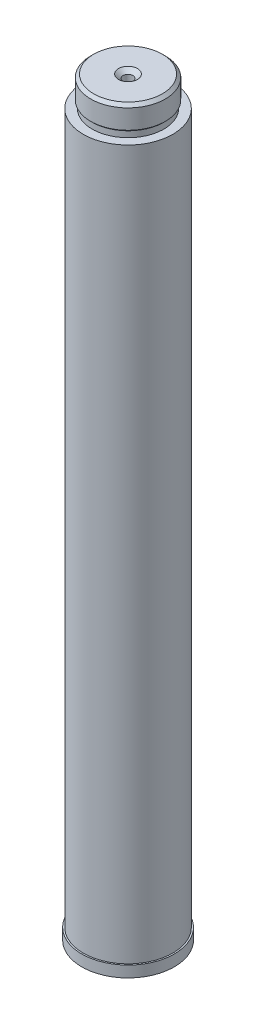
ISO-10303-21;
HEADER;
FILE_DESCRIPTION(('STEP AP214'),'2;1');
FILE_NAME('part.step','',(''),(''),'','','');
FILE_SCHEMA(('AUTOMOTIVE_DESIGN { 1 0 10303 214 1 1 1 1 }'));
ENDSEC;
DATA;
#1=APPLICATION_CONTEXT('core data for automotive mechanical design processes');
#2=APPLICATION_PROTOCOL_DEFINITION('international standard','automotive_design',2000,#1);
#3=PRODUCT_CONTEXT('',#1,'mechanical');
#4=PRODUCT('Part','Part','',(#3));
#5=PRODUCT_RELATED_PRODUCT_CATEGORY('part','',(#4));
#6=PRODUCT_DEFINITION_FORMATION('','',#4);
#7=PRODUCT_DEFINITION_CONTEXT('part definition',#1,'design');
#8=PRODUCT_DEFINITION('design','',#6,#7);
#9=PRODUCT_DEFINITION_SHAPE('','',#8);
#10=(LENGTH_UNIT() NAMED_UNIT(*) SI_UNIT(.MILLI.,.METRE.));
#11=(NAMED_UNIT(*) PLANE_ANGLE_UNIT() SI_UNIT($,.RADIAN.));
#12=(NAMED_UNIT(*) SI_UNIT($,.STERADIAN.) SOLID_ANGLE_UNIT());
#13=UNCERTAINTY_MEASURE_WITH_UNIT(LENGTH_MEASURE(1.E-05),#10,'distance_accuracy_value','');
#14=(GEOMETRIC_REPRESENTATION_CONTEXT(3) GLOBAL_UNCERTAINTY_ASSIGNED_CONTEXT((#13)) GLOBAL_UNIT_ASSIGNED_CONTEXT((#10,
#11,#12)) REPRESENTATION_CONTEXT('',''));
#15=CARTESIAN_POINT('',(0.,0.,0.));
#16=DIRECTION('',(0.,0.,1.));
#17=DIRECTION('',(1.,0.,0.));
#18=AXIS2_PLACEMENT_3D('',#15,#16,#17);
#19=CARTESIAN_POINT('',(0.,9.525,0.));
#20=DIRECTION('',(0.,-1.,0.));
#21=DIRECTION('',(0.,0.,-1.));
#22=AXIS2_PLACEMENT_3D('',#19,#20,#21);
#23=CYLINDRICAL_SURFACE('',#22,39.37);
#24=CARTESIAN_POINT('',(0.,9.525,0.));
#25=DIRECTION('',(0.,1.,0.));
#26=DIRECTION('',(0.,0.,1.));
#27=AXIS2_PLACEMENT_3D('',#24,#25,#26);
#28=CIRCLE('',#27,39.37);
#29=CARTESIAN_POINT('',(0.,9.525,-39.37));
#30=VERTEX_POINT('',#29);
#31=EDGE_CURVE('E39',#30,#30,#28,.T.);
#32=CARTESIAN_POINT('',(0.,0.,0.));
#33=DIRECTION('',(0.,1.,0.));
#34=DIRECTION('',(0.,0.,1.));
#35=AXIS2_PLACEMENT_3D('',#32,#33,#34);
#36=CIRCLE('',#35,39.37);
#37=CARTESIAN_POINT('',(0.,0.,-39.37));
#38=VERTEX_POINT('',#37);
#39=EDGE_CURVE('E35',#38,#38,#36,.T.);
#40=CARTESIAN_POINT('',(0.,9.525,-39.37));
#41=CARTESIAN_POINT('',(0.,9.42578125,-39.37));
#42=CARTESIAN_POINT('',(0.,9.3265625,-39.37));
#43=CARTESIAN_POINT('',(0.,9.128125,-39.37));
#44=CARTESIAN_POINT('',(0.,9.02890625,-39.37));
#45=CARTESIAN_POINT('',(0.,8.83046875,-39.37));
#46=CARTESIAN_POINT('',(0.,8.73125,-39.37));
#47=CARTESIAN_POINT('',(0.,8.5328125,-39.37));
#48=CARTESIAN_POINT('',(0.,8.43359375,-39.37));
#49=CARTESIAN_POINT('',(0.,8.23515625,-39.37));
#50=CARTESIAN_POINT('',(0.,8.1359375,-39.37));
#51=CARTESIAN_POINT('',(0.,7.9375,-39.37));
#52=CARTESIAN_POINT('',(0.,7.83828125,-39.37));
#53=CARTESIAN_POINT('',(0.,7.63984375,-39.37));
#54=CARTESIAN_POINT('',(0.,7.540625,-39.37));
#55=CARTESIAN_POINT('',(0.,7.3421875,-39.37));
#56=CARTESIAN_POINT('',(0.,7.24296875,-39.37));
#57=CARTESIAN_POINT('',(0.,7.04453125,-39.37));
#58=CARTESIAN_POINT('',(0.,6.9453125,-39.37));
#59=CARTESIAN_POINT('',(0.,6.746875,-39.37));
#60=CARTESIAN_POINT('',(0.,6.64765625,-39.37));
#61=CARTESIAN_POINT('',(0.,6.44921875,-39.37));
#62=CARTESIAN_POINT('',(0.,6.35,-39.37));
#63=CARTESIAN_POINT('',(0.,6.1515625,-39.37));
#64=CARTESIAN_POINT('',(0.,6.05234375,-39.37));
#65=CARTESIAN_POINT('',(0.,5.85390625,-39.37));
#66=CARTESIAN_POINT('',(0.,5.7546875,-39.37));
#67=CARTESIAN_POINT('',(0.,5.55625,-39.37));
#68=CARTESIAN_POINT('',(0.,5.45703125,-39.37));
#69=CARTESIAN_POINT('',(0.,5.25859375,-39.37));
#70=CARTESIAN_POINT('',(0.,5.159375,-39.37));
#71=CARTESIAN_POINT('',(0.,4.9609375,-39.37));
#72=CARTESIAN_POINT('',(0.,4.86171875,-39.37));
#73=CARTESIAN_POINT('',(0.,4.66328125,-39.37));
#74=CARTESIAN_POINT('',(0.,4.5640625,-39.37));
#75=CARTESIAN_POINT('',(0.,4.365625,-39.37));
#76=CARTESIAN_POINT('',(0.,4.26640625,-39.37));
#77=CARTESIAN_POINT('',(0.,4.06796875,-39.37));
#78=CARTESIAN_POINT('',(0.,3.96875,-39.37));
#79=CARTESIAN_POINT('',(0.,3.7703125,-39.37));
#80=CARTESIAN_POINT('',(0.,3.67109375,-39.37));
#81=CARTESIAN_POINT('',(0.,3.47265625,-39.37));
#82=CARTESIAN_POINT('',(0.,3.3734375,-39.37));
#83=CARTESIAN_POINT('',(0.,3.175,-39.37));
#84=CARTESIAN_POINT('',(0.,3.07578125,-39.37));
#85=CARTESIAN_POINT('',(0.,2.87734375,-39.37));
#86=CARTESIAN_POINT('',(0.,2.778125,-39.37));
#87=CARTESIAN_POINT('',(0.,2.5796875,-39.37));
#88=CARTESIAN_POINT('',(0.,2.48046875,-39.37));
#89=CARTESIAN_POINT('',(0.,2.28203125,-39.37));
#90=CARTESIAN_POINT('',(0.,2.1828125,-39.37));
#91=CARTESIAN_POINT('',(0.,1.984375,-39.37));
#92=CARTESIAN_POINT('',(0.,1.88515625,-39.37));
#93=CARTESIAN_POINT('',(0.,1.68671875,-39.37));
#94=CARTESIAN_POINT('',(0.,1.5875,-39.37));
#95=CARTESIAN_POINT('',(0.,1.3890625,-39.37));
#96=CARTESIAN_POINT('',(0.,1.28984375,-39.37));
#97=CARTESIAN_POINT('',(0.,1.09140625,-39.37));
#98=CARTESIAN_POINT('',(0.,0.992187500000001,-39.37));
#99=CARTESIAN_POINT('',(0.,0.793750000000001,-39.37));
#100=CARTESIAN_POINT('',(0.,0.69453125,-39.37));
#101=CARTESIAN_POINT('',(0.,0.49609375,-39.37));
#102=CARTESIAN_POINT('',(0.,0.396875,-39.37));
#103=CARTESIAN_POINT('',(0.,0.1984375,-39.37));
#104=CARTESIAN_POINT('',(0.,0.0992187500000001,-39.37));
#105=CARTESIAN_POINT('',(0.,0.,-39.37));
#106=B_SPLINE_CURVE_WITH_KNOTS('',3,(#40,#41,#42,#43,#44,#45,#46,#47,#48,#49,#50,#51,#52,#53,
#54,#55,#56,#57,#58,#59,#60,#61,#62,#63,#64,#65,#66,#67,#68,#69,#70,#71,#72,#73,#74,#75,#76,#77,
#78,#79,#80,#81,#82,#83,#84,#85,#86,#87,#88,#89,#90,#91,#92,#93,#94,#95,#96,#97,#98,#99,#100,
#101,#102,#103,#104,#105),.UNSPECIFIED.,.F.,.F.,(4,2,2,2,2,2,2,2,2,2,2,2,2,2,2,2,2,2,2,2,2,2,2,
2,2,2,2,2,2,2,2,2,4),(0.,0.297656249999998,0.595312499999999,0.892968749999999,1.190625,
1.48828125,1.7859375,2.08359375,2.38125,2.67890625,2.9765625,3.27421875,3.571875,3.86953125,
4.1671875,4.46484375,4.7625,5.06015625,5.3578125,5.65546875,5.953125,6.25078125,6.5484375,
6.84609375,7.14375,7.44140625,7.7390625,8.03671875,8.334375,8.63203125,8.9296875,9.22734375,
9.525),.UNSPECIFIED.);
#107=EDGE_CURVE('BSEAM32',#30,#38,#106,.T.);
#108=ORIENTED_EDGE('',*,*,#31,.F.);
#109=ORIENTED_EDGE('',*,*,#39,.T.);
#110=ORIENTED_EDGE('',*,*,#107,.T.);
#111=ORIENTED_EDGE('',*,*,#107,.F.);
#112=EDGE_LOOP('',(#108,#110,#109,#111));
#113=FACE_BOUND('',#112,.T.);
#114=ADVANCED_FACE('F32',(#113),#23,.T.);
#115=CARTESIAN_POINT('',(0.,9.525,0.));
#116=DIRECTION('',(0.,1.,0.));
#117=DIRECTION('',(0.,0.,1.));
#118=AXIS2_PLACEMENT_3D('',#115,#116,#117);
#119=PLANE('',#118);
#120=CARTESIAN_POINT('',(0.,9.525,0.));
#121=DIRECTION('',(0.,1.,0.));
#122=DIRECTION('',(0.,0.,1.));
#123=AXIS2_PLACEMENT_3D('',#120,#121,#122);
#124=CIRCLE('',#123,38.1);
#125=CARTESIAN_POINT('',(0.,9.525,38.1));
#126=VERTEX_POINT('',#125);
#127=EDGE_CURVE('E11',#126,#126,#124,.T.);
#128=ORIENTED_EDGE('',*,*,#127,.F.);
#129=EDGE_LOOP('',(#128));
#130=FACE_BOUND('',#129,.T.);
#131=ORIENTED_EDGE('',*,*,#31,.T.);
#132=EDGE_LOOP('',(#131));
#133=FACE_BOUND('',#132,.T.);
#134=ADVANCED_FACE('F99',(#130,#133),#119,.T.);
#135=CARTESIAN_POINT('',(0.,0.,0.));
#136=DIRECTION('',(0.,1.,0.));
#137=DIRECTION('',(0.,0.,1.));
#138=AXIS2_PLACEMENT_3D('',#135,#136,#137);
#139=PLANE('',#138);
#140=CARTESIAN_POINT('',(0.,0.,0.));
#141=DIRECTION('',(0.,1.,0.));
#142=DIRECTION('',(0.,0.,1.));
#143=AXIS2_PLACEMENT_3D('',#140,#141,#142);
#144=CIRCLE('',#143,36.83);
#145=CARTESIAN_POINT('',(0.,0.,-36.83));
#146=VERTEX_POINT('',#145);
#147=EDGE_CURVE('E80',#146,#146,#144,.T.);
#148=ORIENTED_EDGE('',*,*,#147,.T.);
#149=EDGE_LOOP('',(#148));
#150=FACE_BOUND('',#149,.T.);
#151=ORIENTED_EDGE('',*,*,#39,.F.);
#152=EDGE_LOOP('',(#151));
#153=FACE_BOUND('',#152,.T.);
#154=ADVANCED_FACE('F96',(#150,#153),#139,.F.);
#155=CARTESIAN_POINT('',(0.,612.775,0.));
#156=DIRECTION('',(0.,-1.,0.));
#157=DIRECTION('',(0.,0.,-1.));
#158=AXIS2_PLACEMENT_3D('',#155,#156,#157);
#159=CYLINDRICAL_SURFACE('',#158,38.1);
#160=CARTESIAN_POINT('',(0.,612.775,0.));
#161=DIRECTION('',(0.,1.,0.));
#162=DIRECTION('',(0.,0.,1.));
#163=AXIS2_PLACEMENT_3D('',#160,#161,#162);
#164=CIRCLE('',#163,38.1);
#165=CARTESIAN_POINT('',(0.,612.775,38.1));
#166=VERTEX_POINT('',#165);
#167=EDGE_CURVE('E83',#166,#166,#164,.T.);
#168=ORIENTED_EDGE('',*,*,#167,.F.);
#169=EDGE_LOOP('',(#168));
#170=FACE_BOUND('',#169,.T.);
#171=ORIENTED_EDGE('',*,*,#127,.T.);
#172=EDGE_LOOP('',(#171));
#173=FACE_BOUND('',#172,.T.);
#174=ADVANCED_FACE('F98',(#170,#173),#159,.T.);
#175=CARTESIAN_POINT('',(0.,612.775,0.));
#176=DIRECTION('',(0.,1.,0.));
#177=DIRECTION('',(0.,0.,1.));
#178=AXIS2_PLACEMENT_3D('',#175,#176,#177);
#179=PLANE('',#178);
#180=CARTESIAN_POINT('',(0.,612.775,0.));
#181=DIRECTION('',(0.,-1.,0.));
#182=DIRECTION('',(0.,0.,-1.));
#183=AXIS2_PLACEMENT_3D('',#180,#181,#182);
#184=CIRCLE('',#183,30.48);
#185=CARTESIAN_POINT('',(0.,612.775,-30.48));
#186=VERTEX_POINT('',#185);
#187=EDGE_CURVE('E72',#186,#186,#184,.T.);
#188=ORIENTED_EDGE('',*,*,#187,.T.);
#189=EDGE_LOOP('',(#188));
#190=FACE_BOUND('',#189,.T.);
#191=ORIENTED_EDGE('',*,*,#167,.T.);
#192=EDGE_LOOP('',(#191));
#193=FACE_BOUND('',#192,.T.);
#194=ADVANCED_FACE('F105',(#190,#193),#179,.T.);
#195=CARTESIAN_POINT('',(0.,9.525,0.));
#196=DIRECTION('',(0.,-1.,0.));
#197=DIRECTION('',(0.,0.,-1.));
#198=AXIS2_PLACEMENT_3D('',#195,#196,#197);
#199=CYLINDRICAL_SURFACE('',#198,36.83);
#200=CARTESIAN_POINT('',(0.,6.985,0.));
#201=DIRECTION('',(0.,1.,0.));
#202=DIRECTION('',(0.,0.,1.));
#203=AXIS2_PLACEMENT_3D('',#200,#201,#202);
#204=CIRCLE('',#203,36.83);
#205=CARTESIAN_POINT('',(0.,6.985,-36.83));
#206=VERTEX_POINT('',#205);
#207=EDGE_CURVE('E76',#206,#206,#204,.T.);
#208=CARTESIAN_POINT('',(0.,6.985,-36.83));
#209=CARTESIAN_POINT('',(0.,6.91223958333333,-36.83));
#210=CARTESIAN_POINT('',(0.,6.83947916666667,-36.83));
#211=CARTESIAN_POINT('',(0.,6.69395833333333,-36.83));
#212=CARTESIAN_POINT('',(0.,6.62119791666667,-36.83));
#213=CARTESIAN_POINT('',(0.,6.47567708333333,-36.83));
#214=CARTESIAN_POINT('',(0.,6.40291666666667,-36.83));
#215=CARTESIAN_POINT('',(0.,6.25739583333333,-36.83));
#216=CARTESIAN_POINT('',(0.,6.18463541666667,-36.83));
#217=CARTESIAN_POINT('',(0.,6.03911458333333,-36.83));
#218=CARTESIAN_POINT('',(0.,5.96635416666667,-36.83));
#219=CARTESIAN_POINT('',(0.,5.82083333333333,-36.83));
#220=CARTESIAN_POINT('',(0.,5.74807291666667,-36.83));
#221=CARTESIAN_POINT('',(0.,5.60255208333333,-36.83));
#222=CARTESIAN_POINT('',(0.,5.52979166666667,-36.83));
#223=CARTESIAN_POINT('',(0.,5.38427083333333,-36.83));
#224=CARTESIAN_POINT('',(0.,5.31151041666667,-36.83));
#225=CARTESIAN_POINT('',(0.,5.16598958333333,-36.83));
#226=CARTESIAN_POINT('',(0.,5.09322916666667,-36.83));
#227=CARTESIAN_POINT('',(0.,4.94770833333333,-36.83));
#228=CARTESIAN_POINT('',(0.,4.87494791666667,-36.83));
#229=CARTESIAN_POINT('',(0.,4.72942708333333,-36.83));
#230=CARTESIAN_POINT('',(0.,4.65666666666667,-36.83));
#231=CARTESIAN_POINT('',(0.,4.51114583333333,-36.83));
#232=CARTESIAN_POINT('',(0.,4.43838541666667,-36.83));
#233=CARTESIAN_POINT('',(0.,4.29286458333333,-36.83));
#234=CARTESIAN_POINT('',(0.,4.22010416666667,-36.83));
#235=CARTESIAN_POINT('',(0.,4.07458333333333,-36.83));
#236=CARTESIAN_POINT('',(0.,4.00182291666667,-36.83));
#237=CARTESIAN_POINT('',(0.,3.85630208333333,-36.83));
#238=CARTESIAN_POINT('',(0.,3.78354166666667,-36.83));
#239=CARTESIAN_POINT('',(0.,3.63802083333333,-36.83));
#240=CARTESIAN_POINT('',(0.,3.56526041666667,-36.83));
#241=CARTESIAN_POINT('',(0.,3.41973958333333,-36.83));
#242=CARTESIAN_POINT('',(0.,3.34697916666667,-36.83));
#243=CARTESIAN_POINT('',(0.,3.20145833333333,-36.83));
#244=CARTESIAN_POINT('',(0.,3.12869791666667,-36.83));
#245=CARTESIAN_POINT('',(0.,2.98317708333333,-36.83));
#246=CARTESIAN_POINT('',(0.,2.91041666666667,-36.83));
#247=CARTESIAN_POINT('',(0.,2.76489583333333,-36.83));
#248=CARTESIAN_POINT('',(0.,2.69213541666667,-36.83));
#249=CARTESIAN_POINT('',(0.,2.54661458333333,-36.83));
#250=CARTESIAN_POINT('',(0.,2.47385416666667,-36.83));
#251=CARTESIAN_POINT('',(0.,2.32833333333333,-36.83));
#252=CARTESIAN_POINT('',(0.,2.25557291666667,-36.83));
#253=CARTESIAN_POINT('',(0.,2.11005208333333,-36.83));
#254=CARTESIAN_POINT('',(0.,2.03729166666667,-36.83));
#255=CARTESIAN_POINT('',(0.,1.89177083333333,-36.83));
#256=CARTESIAN_POINT('',(0.,1.81901041666667,-36.83));
#257=CARTESIAN_POINT('',(0.,1.67348958333333,-36.83));
#258=CARTESIAN_POINT('',(0.,1.60072916666667,-36.83));
#259=CARTESIAN_POINT('',(0.,1.45520833333333,-36.83));
#260=CARTESIAN_POINT('',(0.,1.38244791666667,-36.83));
#261=CARTESIAN_POINT('',(0.,1.23692708333333,-36.83));
#262=CARTESIAN_POINT('',(0.,1.16416666666667,-36.83));
#263=CARTESIAN_POINT('',(0.,1.01864583333333,-36.83));
#264=CARTESIAN_POINT('',(0.,0.945885416666666,-36.83));
#265=CARTESIAN_POINT('',(0.,0.800364583333333,-36.83));
#266=CARTESIAN_POINT('',(0.,0.727604166666666,-36.83));
#267=CARTESIAN_POINT('',(0.,0.582083333333334,-36.83));
#268=CARTESIAN_POINT('',(0.,0.509322916666668,-36.83));
#269=CARTESIAN_POINT('',(0.,0.363802083333334,-36.83));
#270=CARTESIAN_POINT('',(0.,0.291041666666667,-36.83));
#271=CARTESIAN_POINT('',(0.,0.145520833333334,-36.83));
#272=CARTESIAN_POINT('',(0.,0.0727604166666668,-36.83));
#273=CARTESIAN_POINT('',(0.,0.,-36.83));
#274=B_SPLINE_CURVE_WITH_KNOTS('',3,(#208,#209,#210,#211,#212,#213,#214,#215,#216,#217,#218,
#219,#220,#221,#222,#223,#224,#225,#226,#227,#228,#229,#230,#231,#232,#233,#234,#235,#236,#237,
#238,#239,#240,#241,#242,#243,#244,#245,#246,#247,#248,#249,#250,#251,#252,#253,#254,#255,#256,
#257,#258,#259,#260,#261,#262,#263,#264,#265,#266,#267,#268,#269,#270,#271,#272,#273),
.UNSPECIFIED.,.F.,.F.,(4,2,2,2,2,2,2,2,2,2,2,2,2,2,2,2,2,2,2,2,2,2,2,2,2,2,2,2,2,2,2,2,4),(0.,
0.218281250000001,0.4365625,0.65484375,0.873125000000001,1.09140625,1.3096875,1.52796875,
1.74625,1.96453125,2.1828125,2.40109375,2.619375,2.83765625,3.0559375,3.27421875,3.4925,
3.71078125,3.9290625,4.14734375,4.365625,4.58390625,4.8021875,5.02046875,5.23875,5.45703125,
5.6753125,5.89359375,6.111875,6.33015625,6.5484375,6.76671875,6.985),.UNSPECIFIED.);
#275=EDGE_CURVE('BSEAM135',#206,#146,#274,.T.);
#276=ORIENTED_EDGE('',*,*,#207,.T.);
#277=ORIENTED_EDGE('',*,*,#147,.F.);
#278=ORIENTED_EDGE('',*,*,#275,.T.);
#279=ORIENTED_EDGE('',*,*,#275,.F.);
#280=EDGE_LOOP('',(#276,#278,#277,#279));
#281=FACE_BOUND('',#280,.T.);
#282=ADVANCED_FACE('F135',(#281),#199,.F.);
#283=CARTESIAN_POINT('',(0.,6.985,0.));
#284=DIRECTION('',(0.,1.,0.));
#285=DIRECTION('',(0.,0.,1.));
#286=AXIS2_PLACEMENT_3D('',#283,#284,#285);
#287=PLANE('',#286);
#288=CARTESIAN_POINT('',(0.,6.98500000000002,0.));
#289=DIRECTION('',(0.,1.,0.));
#290=DIRECTION('',(0.,0.,1.));
#291=AXIS2_PLACEMENT_3D('',#288,#289,#290);
#292=CIRCLE('',#291,35.56);
#293=CARTESIAN_POINT('',(0.,6.98500000000002,35.56));
#294=VERTEX_POINT('',#293);
#295=EDGE_CURVE('E79',#294,#294,#292,.T.);
#296=ORIENTED_EDGE('',*,*,#295,.T.);
#297=EDGE_LOOP('',(#296));
#298=FACE_BOUND('',#297,.T.);
#299=ORIENTED_EDGE('',*,*,#207,.F.);
#300=EDGE_LOOP('',(#299));
#301=FACE_BOUND('',#300,.T.);
#302=ADVANCED_FACE('F140',(#298,#301),#287,.F.);
#303=CARTESIAN_POINT('',(0.,612.775,0.));
#304=DIRECTION('',(0.,-1.,0.));
#305=DIRECTION('',(0.,0.,-1.));
#306=AXIS2_PLACEMENT_3D('',#303,#304,#305);
#307=CYLINDRICAL_SURFACE('',#306,35.56);
#308=CARTESIAN_POINT('',(0.,610.235,0.));
#309=DIRECTION('',(0.,1.,0.));
#310=DIRECTION('',(0.,0.,1.));
#311=AXIS2_PLACEMENT_3D('',#308,#309,#310);
#312=CIRCLE('',#311,35.56);
#313=CARTESIAN_POINT('',(0.,610.235,35.56));
#314=VERTEX_POINT('',#313);
#315=EDGE_CURVE('E75',#314,#314,#312,.T.);
#316=ORIENTED_EDGE('',*,*,#315,.T.);
#317=EDGE_LOOP('',(#316));
#318=FACE_BOUND('',#317,.T.);
#319=ORIENTED_EDGE('',*,*,#295,.F.);
#320=EDGE_LOOP('',(#319));
#321=FACE_BOUND('',#320,.T.);
#322=ADVANCED_FACE('F150',(#318,#321),#307,.F.);
#323=CARTESIAN_POINT('',(0.,610.235,0.));
#324=DIRECTION('',(0.,1.,0.));
#325=DIRECTION('',(0.,0.,1.));
#326=AXIS2_PLACEMENT_3D('',#323,#324,#325);
#327=PLANE('',#326);
#328=ORIENTED_EDGE('',*,*,#315,.F.);
#329=EDGE_LOOP('',(#328));
#330=FACE_BOUND('',#329,.T.);
#331=ADVANCED_FACE('F160',(#330),#327,.F.);
#332=CARTESIAN_POINT('',(0.,0.,0.));
#333=DIRECTION('',(0.,-1.,0.));
#334=DIRECTION('',(0.,0.,-1.));
#335=AXIS2_PLACEMENT_3D('',#332,#333,#334);
#336=CYLINDRICAL_SURFACE('',#335,30.48);
#337=CARTESIAN_POINT('',(0.,617.855,0.));
#338=DIRECTION('',(0.,-1.,0.));
#339=DIRECTION('',(0.,0.,-1.));
#340=AXIS2_PLACEMENT_3D('',#337,#338,#339);
#341=CIRCLE('',#340,30.48);
#342=CARTESIAN_POINT('',(0.,617.855,-30.48));
#343=VERTEX_POINT('',#342);
#344=EDGE_CURVE('E69',#343,#343,#341,.T.);
#345=ORIENTED_EDGE('',*,*,#344,.T.);
#346=EDGE_LOOP('',(#345));
#347=FACE_BOUND('',#346,.T.);
#348=ORIENTED_EDGE('',*,*,#187,.F.);
#349=EDGE_LOOP('',(#348));
#350=FACE_BOUND('',#349,.T.);
#351=ADVANCED_FACE('F170',(#347,#350),#336,.T.);
#352=CARTESIAN_POINT('',(0.,617.855,0.));
#353=DIRECTION('',(0.,1.,0.));
#354=DIRECTION('',(0.,0.,1.));
#355=AXIS2_PLACEMENT_3D('',#352,#353,#354);
#356=CONICAL_SURFACE('',#355,30.48,0.785398163397451);
#357=CARTESIAN_POINT('',(0.,619.125,0.));
#358=DIRECTION('',(0.,-1.,0.));
#359=DIRECTION('',(0.,0.,-1.));
#360=AXIS2_PLACEMENT_3D('',#357,#358,#359);
#361=CIRCLE('',#360,31.75);
#362=CARTESIAN_POINT('',(0.,619.125,-31.75));
#363=VERTEX_POINT('',#362);
#364=EDGE_CURVE('E66',#363,#363,#361,.T.);
#365=ORIENTED_EDGE('',*,*,#364,.T.);
#366=EDGE_LOOP('',(#365));
#367=FACE_BOUND('',#366,.T.);
#368=ORIENTED_EDGE('',*,*,#344,.F.);
#369=EDGE_LOOP('',(#368));
#370=FACE_BOUND('',#369,.T.);
#371=ADVANCED_FACE('F187',(#367,#370),#356,.T.);
#372=CARTESIAN_POINT('',(0.,0.,0.));
#373=DIRECTION('',(0.,-1.,0.));
#374=DIRECTION('',(0.,0.,-1.));
#375=AXIS2_PLACEMENT_3D('',#372,#373,#374);
#376=CYLINDRICAL_SURFACE('',#375,31.75);
#377=CARTESIAN_POINT('',(0.,635.635,0.));
#378=DIRECTION('',(0.,-1.,0.));
#379=DIRECTION('',(0.,0.,-1.));
#380=AXIS2_PLACEMENT_3D('',#377,#378,#379);
#381=CIRCLE('',#380,31.75);
#382=CARTESIAN_POINT('',(0.,635.635,-31.75));
#383=VERTEX_POINT('',#382);
#384=EDGE_CURVE('E57',#383,#383,#381,.T.);
#385=ORIENTED_EDGE('',*,*,#384,.T.);
#386=EDGE_LOOP('',(#385));
#387=FACE_BOUND('',#386,.T.);
#388=ORIENTED_EDGE('',*,*,#364,.F.);
#389=EDGE_LOOP('',(#388));
#390=FACE_BOUND('',#389,.T.);
#391=ADVANCED_FACE('F197',(#387,#390),#376,.T.);
#392=CARTESIAN_POINT('',(0.,635.635,0.));
#393=DIRECTION('',(0.,-1.,0.));
#394=DIRECTION('',(0.,0.,-1.));
#395=AXIS2_PLACEMENT_3D('',#392,#393,#394);
#396=CONICAL_SURFACE('',#395,31.75,0.785398163397451);
#397=CARTESIAN_POINT('',(0.,638.175,0.));
#398=DIRECTION('',(0.,-1.,0.));
#399=DIRECTION('',(0.,0.,-1.));
#400=AXIS2_PLACEMENT_3D('',#397,#398,#399);
#401=CIRCLE('',#400,29.21);
#402=CARTESIAN_POINT('',(0.,638.175,-29.21));
#403=VERTEX_POINT('',#402);
#404=EDGE_CURVE('E53',#403,#403,#401,.T.);
#405=ORIENTED_EDGE('',*,*,#404,.T.);
#406=EDGE_LOOP('',(#405));
#407=FACE_BOUND('',#406,.T.);
#408=ORIENTED_EDGE('',*,*,#384,.F.);
#409=EDGE_LOOP('',(#408));
#410=FACE_BOUND('',#409,.T.);
#411=ADVANCED_FACE('F207',(#407,#410),#396,.T.);
#412=CARTESIAN_POINT('',(29.21,638.175,0.));
#413=DIRECTION('',(0.,1.,0.));
#414=DIRECTION('',(0.,0.,1.));
#415=AXIS2_PLACEMENT_3D('',#412,#413,#414);
#416=PLANE('',#415);
#417=CARTESIAN_POINT('',(0.,638.175,0.));
#418=DIRECTION('',(0.,1.,0.));
#419=DIRECTION('',(0.,0.,1.));
#420=AXIS2_PLACEMENT_3D('',#417,#418,#419);
#421=CIRCLE('',#420,8.0645);
#422=CARTESIAN_POINT('',(0.,638.175,8.0645));
#423=VERTEX_POINT('',#422);
#424=EDGE_CURVE('E60',#423,#423,#421,.T.);
#425=ORIENTED_EDGE('',*,*,#424,.F.);
#426=EDGE_LOOP('',(#425));
#427=FACE_BOUND('',#426,.T.);
#428=ORIENTED_EDGE('',*,*,#404,.F.);
#429=EDGE_LOOP('',(#428));
#430=FACE_BOUND('',#429,.T.);
#431=ADVANCED_FACE('F47',(#427,#430),#416,.T.);
#432=CARTESIAN_POINT('',(0.,625.475,0.));
#433=DIRECTION('',(0.,1.,0.));
#434=DIRECTION('',(0.,0.,1.));
#435=AXIS2_PLACEMENT_3D('',#432,#433,#434);
#436=CONICAL_SURFACE('',#435,4.2164,1.02974425867666);
#437=CARTESIAN_POINT('',(0.,622.941531285932,0.));
#438=VERTEX_POINT('',#437);
#439=VERTEX_LOOP('',#438);
#440=FACE_BOUND('',#439,.T.);
#441=CARTESIAN_POINT('',(0.,625.475,0.));
#442=DIRECTION('',(0.,1.,0.));
#443=DIRECTION('',(0.,0.,1.));
#444=AXIS2_PLACEMENT_3D('',#441,#442,#443);
#445=CIRCLE('',#444,4.2164);
#446=CARTESIAN_POINT('',(0.,625.475,4.2164));
#447=VERTEX_POINT('',#446);
#448=EDGE_CURVE('E51',#447,#447,#445,.T.);
#449=ORIENTED_EDGE('',*,*,#448,.T.);
#450=EDGE_LOOP('',(#449));
#451=FACE_BOUND('',#450,.T.);
#452=ADVANCED_FACE('F43',(#440,#451),#436,.F.);
#453=CARTESIAN_POINT('',(0.,638.175,0.));
#454=DIRECTION('',(0.,1.,0.));
#455=DIRECTION('',(0.,0.,1.));
#456=AXIS2_PLACEMENT_3D('',#453,#454,#455);
#457=CYLINDRICAL_SURFACE('',#456,4.2164);
#458=ORIENTED_EDGE('',*,*,#448,.F.);
#459=EDGE_LOOP('',(#458));
#460=FACE_BOUND('',#459,.T.);
#461=CARTESIAN_POINT('',(0.,634.946060709267,0.));
#462=DIRECTION('',(0.,1.,0.));
#463=DIRECTION('',(0.,0.,1.));
#464=AXIS2_PLACEMENT_3D('',#461,#462,#463);
#465=CIRCLE('',#464,4.2164);
#466=CARTESIAN_POINT('',(0.,634.946060709267,4.2164));
#467=VERTEX_POINT('',#466);
#468=EDGE_CURVE('E54',#467,#467,#465,.T.);
#469=ORIENTED_EDGE('',*,*,#468,.T.);
#470=EDGE_LOOP('',(#469));
#471=FACE_BOUND('',#470,.T.);
#472=ADVANCED_FACE('F46',(#460,#471),#457,.F.);
#473=CARTESIAN_POINT('',(0.,638.175,0.));
#474=DIRECTION('',(0.,1.,0.));
#475=DIRECTION('',(0.,0.,1.));
#476=AXIS2_PLACEMENT_3D('',#473,#474,#475);
#477=CONICAL_SURFACE('',#476,8.0645,0.872664625997162);
#478=ORIENTED_EDGE('',*,*,#468,.F.);
#479=EDGE_LOOP('',(#478));
#480=FACE_BOUND('',#479,.T.);
#481=ORIENTED_EDGE('',*,*,#424,.T.);
#482=EDGE_LOOP('',(#481));
#483=FACE_BOUND('',#482,.T.);
#484=ADVANCED_FACE('F241',(#480,#483),#477,.F.);
#485=CLOSED_SHELL('',(#114,#134,#154,#174,#194,#282,#302,#322,#331,#351,#371,#391,#411,#431,
#452,#472,#484));
#486=MANIFOLD_SOLID_BREP('B2',#485);
#487=ADVANCED_BREP_SHAPE_REPRESENTATION('',(#18,#486),#14);
#488=SHAPE_DEFINITION_REPRESENTATION(#9,#487);
ENDSEC;
END-ISO-10303-21;
